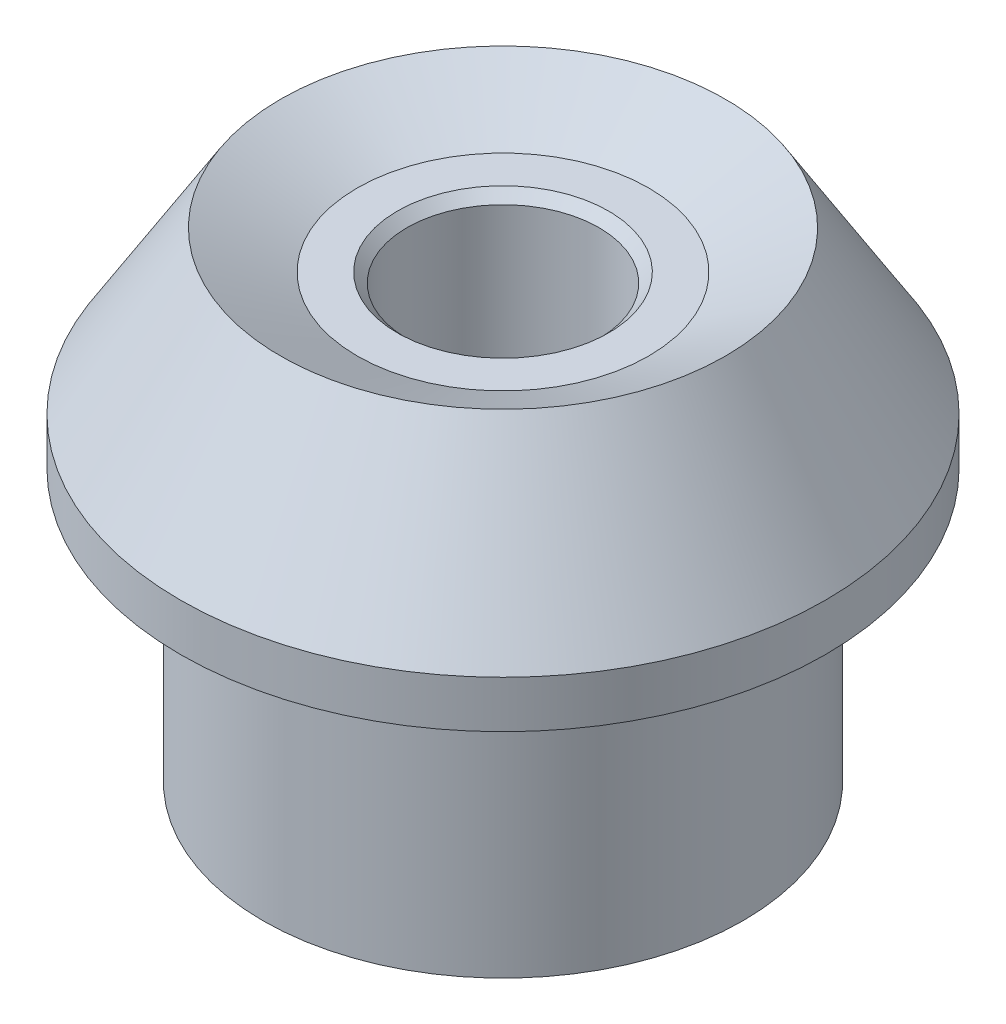
ISO-10303-21;
HEADER;
FILE_DESCRIPTION(('STEP AP214'),'2;1');
FILE_NAME('part.step','',(''),(''),'','','');
FILE_SCHEMA(('AUTOMOTIVE_DESIGN { 1 0 10303 214 1 1 1 1 }'));
ENDSEC;
DATA;
#1=APPLICATION_CONTEXT('core data for automotive mechanical design processes');
#2=APPLICATION_PROTOCOL_DEFINITION('international standard','automotive_design',2000,#1);
#3=PRODUCT_CONTEXT('',#1,'mechanical');
#4=PRODUCT('Part','Part','',(#3));
#5=PRODUCT_RELATED_PRODUCT_CATEGORY('part','',(#4));
#6=PRODUCT_DEFINITION_FORMATION('','',#4);
#7=PRODUCT_DEFINITION_CONTEXT('part definition',#1,'design');
#8=PRODUCT_DEFINITION('design','',#6,#7);
#9=PRODUCT_DEFINITION_SHAPE('','',#8);
#10=(LENGTH_UNIT() NAMED_UNIT(*) SI_UNIT(.MILLI.,.METRE.));
#11=(NAMED_UNIT(*) PLANE_ANGLE_UNIT() SI_UNIT($,.RADIAN.));
#12=(NAMED_UNIT(*) SI_UNIT($,.STERADIAN.) SOLID_ANGLE_UNIT());
#13=UNCERTAINTY_MEASURE_WITH_UNIT(LENGTH_MEASURE(1.E-05),#10,'distance_accuracy_value','');
#14=(GEOMETRIC_REPRESENTATION_CONTEXT(3) GLOBAL_UNCERTAINTY_ASSIGNED_CONTEXT((#13)) GLOBAL_UNIT_ASSIGNED_CONTEXT((#10,
#11,#12)) REPRESENTATION_CONTEXT('',''));
#15=CARTESIAN_POINT('',(0.,0.,0.));
#16=DIRECTION('',(0.,0.,1.));
#17=DIRECTION('',(1.,0.,0.));
#18=AXIS2_PLACEMENT_3D('',#15,#16,#17);
#19=CARTESIAN_POINT('',(7.5828586647019,23.,0.));
#20=DIRECTION('',(0.,1.,0.));
#21=DIRECTION('',(-1.,0.,0.));
#22=AXIS2_PLACEMENT_3D('',#19,#20,#21);
#23=PLANE('',#22);
#24=CARTESIAN_POINT('',(0.,23.0000000000246,0.));
#25=DIRECTION('',(0.,1.,0.));
#26=DIRECTION('',(-1.,0.,0.));
#27=AXIS2_PLACEMENT_3D('',#24,#25,#26);
#28=CIRCLE('',#27,5.49999999998361);
#29=CARTESIAN_POINT('',(-5.4999999999836,23.0000000000246,0.));
#30=VERTEX_POINT('',#29);
#31=EDGE_CURVE('E18',#30,#30,#28,.F.);
#32=ORIENTED_EDGE('',*,*,#31,.T.);
#33=EDGE_LOOP('',(#32));
#34=FACE_BOUND('',#33,.T.);
#35=CARTESIAN_POINT('',(0.,23.,0.));
#36=DIRECTION('',(0.,1.,0.));
#37=DIRECTION('',(-1.,0.,0.));
#38=AXIS2_PLACEMENT_3D('',#35,#36,#37);
#39=CIRCLE('',#38,7.5828586647019);
#40=CARTESIAN_POINT('',(-7.5828586647019,23.,0.));
#41=VERTEX_POINT('',#40);
#42=EDGE_CURVE('E43',#41,#41,#39,.T.);
#43=ORIENTED_EDGE('',*,*,#42,.T.);
#44=EDGE_LOOP('',(#43));
#45=FACE_BOUND('',#44,.T.);
#46=ADVANCED_FACE('F15',(#34,#45),#23,.T.);
#47=CARTESIAN_POINT('',(0.,22.9999999999677,0.));
#48=DIRECTION('',(0.,1.,0.));
#49=DIRECTION('',(-1.,0.,0.));
#50=AXIS2_PLACEMENT_3D('',#47,#48,#49);
#51=CONICAL_SURFACE('',#50,5.49999999992677,0.785398163340605);
#52=ORIENTED_EDGE('',*,*,#31,.F.);
#53=EDGE_LOOP('',(#52));
#54=FACE_BOUND('',#53,.T.);
#55=CARTESIAN_POINT('',(0.,22.5,0.));
#56=DIRECTION('',(0.,-1.,0.));
#57=DIRECTION('',(1.,0.,0.));
#58=AXIS2_PLACEMENT_3D('',#55,#56,#57);
#59=CIRCLE('',#58,5.);
#60=CARTESIAN_POINT('',(5.00000000000001,22.5,0.));
#61=VERTEX_POINT('',#60);
#62=EDGE_CURVE('E40',#61,#61,#59,.T.);
#63=ORIENTED_EDGE('',*,*,#62,.T.);
#64=EDGE_LOOP('',(#63));
#65=FACE_BOUND('',#64,.T.);
#66=ADVANCED_FACE('F54',(#54,#65),#51,.F.);
#67=CARTESIAN_POINT('',(0.,25.,0.));
#68=DIRECTION('',(0.,1.,0.));
#69=DIRECTION('',(-1.,0.,0.));
#70=AXIS2_PLACEMENT_3D('',#67,#68,#69);
#71=CONICAL_SURFACE('',#70,11.582858870141,1.107148738338);
#72=CARTESIAN_POINT('',(0.,25.,0.));
#73=DIRECTION('',(0.,-1.,0.));
#74=DIRECTION('',(1.,0.,0.));
#75=AXIS2_PLACEMENT_3D('',#72,#73,#74);
#76=CIRCLE('',#75,11.582858870141);
#77=CARTESIAN_POINT('',(11.582858870141,25.,0.));
#78=VERTEX_POINT('',#77);
#79=EDGE_CURVE('E37',#78,#78,#76,.T.);
#80=ORIENTED_EDGE('',*,*,#79,.F.);
#81=EDGE_LOOP('',(#80));
#82=FACE_BOUND('',#81,.T.);
#83=ORIENTED_EDGE('',*,*,#42,.F.);
#84=EDGE_LOOP('',(#83));
#85=FACE_BOUND('',#84,.T.);
#86=ADVANCED_FACE('F57',(#82,#85),#71,.F.);
#87=CARTESIAN_POINT('',(0.,21.845,0.));
#88=DIRECTION('',(0.,-1.,0.));
#89=DIRECTION('',(1.,0.,0.));
#90=AXIS2_PLACEMENT_3D('',#87,#88,#89);
#91=CYLINDRICAL_SURFACE('',#90,5.);
#92=CARTESIAN_POINT('',(0.,0.499999999988173,0.));
#93=DIRECTION('',(0.,-1.,0.));
#94=DIRECTION('',(-1.,0.,0.));
#95=AXIS2_PLACEMENT_3D('',#92,#93,#94);
#96=CIRCLE('',#95,4.99999999993861);
#97=CARTESIAN_POINT('',(-4.99999999993861,0.499999999988177,0.));
#98=VERTEX_POINT('',#97);
#99=EDGE_CURVE('E34',#98,#98,#96,.T.);
#100=ORIENTED_EDGE('',*,*,#99,.T.);
#101=EDGE_LOOP('',(#100));
#102=FACE_BOUND('',#101,.T.);
#103=ORIENTED_EDGE('',*,*,#62,.F.);
#104=EDGE_LOOP('',(#103));
#105=FACE_BOUND('',#104,.T.);
#106=ADVANCED_FACE('F60',(#102,#105),#91,.F.);
#107=CARTESIAN_POINT('',(0.,16.597802510747,0.));
#108=DIRECTION('',(0.,-1.,0.));
#109=DIRECTION('',(1.,0.,0.));
#110=AXIS2_PLACEMENT_3D('',#107,#108,#109);
#111=CONICAL_SURFACE('',#110,16.79,0.554804739025165);
#112=ORIENTED_EDGE('',*,*,#79,.T.);
#113=EDGE_LOOP('',(#112));
#114=FACE_BOUND('',#113,.T.);
#115=CARTESIAN_POINT('',(0.,16.597802510747,0.));
#116=DIRECTION('',(0.,-1.,0.));
#117=DIRECTION('',(1.,0.,0.));
#118=AXIS2_PLACEMENT_3D('',#115,#116,#117);
#119=CIRCLE('',#118,16.79);
#120=CARTESIAN_POINT('',(16.79,16.597802510747,0.));
#121=VERTEX_POINT('',#120);
#122=EDGE_CURVE('E30',#121,#121,#119,.T.);
#123=ORIENTED_EDGE('',*,*,#122,.F.);
#124=EDGE_LOOP('',(#123));
#125=FACE_BOUND('',#124,.T.);
#126=ADVANCED_FACE('F62',(#114,#125),#111,.T.);
#127=CARTESIAN_POINT('',(0.,0.,0.));
#128=DIRECTION('',(0.,-1.,0.));
#129=DIRECTION('',(1.,0.,0.));
#130=AXIS2_PLACEMENT_3D('',#127,#128,#129);
#131=CONICAL_SURFACE('',#130,5.49999999992679,0.785398163397448);
#132=CARTESIAN_POINT('',(0.,0.,0.));
#133=DIRECTION('',(0.,-1.,0.));
#134=DIRECTION('',(1.,0.,0.));
#135=AXIS2_PLACEMENT_3D('',#132,#133,#134);
#136=CIRCLE('',#135,5.49999999992678);
#137=CARTESIAN_POINT('',(5.49999999992678,0.,0.));
#138=VERTEX_POINT('',#137);
#139=EDGE_CURVE('E33',#138,#138,#136,.F.);
#140=ORIENTED_EDGE('',*,*,#139,.F.);
#141=EDGE_LOOP('',(#140));
#142=FACE_BOUND('',#141,.T.);
#143=ORIENTED_EDGE('',*,*,#99,.F.);
#144=EDGE_LOOP('',(#143));
#145=FACE_BOUND('',#144,.T.);
#146=ADVANCED_FACE('F70',(#142,#145),#131,.F.);
#147=CARTESIAN_POINT('',(0.,15.37140120029,0.));
#148=DIRECTION('',(0.,-1.,0.));
#149=DIRECTION('',(1.,0.,0.));
#150=AXIS2_PLACEMENT_3D('',#147,#148,#149);
#151=CYLINDRICAL_SURFACE('',#150,16.79);
#152=ORIENTED_EDGE('',*,*,#122,.T.);
#153=EDGE_LOOP('',(#152));
#154=FACE_BOUND('',#153,.T.);
#155=CARTESIAN_POINT('',(0.,14.144999889833,0.));
#156=DIRECTION('',(0.,1.,0.));
#157=DIRECTION('',(1.,0.,0.));
#158=AXIS2_PLACEMENT_3D('',#155,#156,#157);
#159=CIRCLE('',#158,16.79);
#160=CARTESIAN_POINT('',(16.79,14.144999889833,0.));
#161=VERTEX_POINT('',#160);
#162=EDGE_CURVE('E27',#161,#161,#159,.F.);
#163=ORIENTED_EDGE('',*,*,#162,.F.);
#164=EDGE_LOOP('',(#163));
#165=FACE_BOUND('',#164,.T.);
#166=ADVANCED_FACE('F89',(#154,#165),#151,.T.);
#167=CARTESIAN_POINT('',(0.,0.,0.));
#168=DIRECTION('',(0.,-1.,0.));
#169=DIRECTION('',(1.,0.,0.));
#170=AXIS2_PLACEMENT_3D('',#167,#168,#169);
#171=PLANE('',#170);
#172=ORIENTED_EDGE('',*,*,#139,.T.);
#173=EDGE_LOOP('',(#172));
#174=FACE_BOUND('',#173,.T.);
#175=CARTESIAN_POINT('',(0.,0.,0.));
#176=DIRECTION('',(0.,-1.,0.));
#177=DIRECTION('',(1.,0.,0.));
#178=AXIS2_PLACEMENT_3D('',#175,#176,#177);
#179=CIRCLE('',#178,12.5);
#180=CARTESIAN_POINT('',(12.5,0.,0.));
#181=VERTEX_POINT('',#180);
#182=EDGE_CURVE('E22',#181,#181,#179,.F.);
#183=ORIENTED_EDGE('',*,*,#182,.F.);
#184=EDGE_LOOP('',(#183));
#185=FACE_BOUND('',#184,.T.);
#186=ADVANCED_FACE('F82',(#174,#185),#171,.T.);
#187=CARTESIAN_POINT('',(0.,14.144999889833,0.));
#188=DIRECTION('',(0.,1.,0.));
#189=DIRECTION('',(-1.,0.,0.));
#190=AXIS2_PLACEMENT_3D('',#187,#188,#189);
#191=CONICAL_SURFACE('',#190,16.79,1.10714873833805);
#192=CARTESIAN_POINT('',(0.,12.,0.));
#193=DIRECTION('',(0.,-1.,0.));
#194=DIRECTION('',(1.,0.,0.));
#195=AXIS2_PLACEMENT_3D('',#192,#193,#194);
#196=CIRCLE('',#195,12.5);
#197=CARTESIAN_POINT('',(12.5,12.,0.));
#198=VERTEX_POINT('',#197);
#199=EDGE_CURVE('E10',#198,#198,#196,.T.);
#200=ORIENTED_EDGE('',*,*,#199,.F.);
#201=EDGE_LOOP('',(#200));
#202=FACE_BOUND('',#201,.T.);
#203=ORIENTED_EDGE('',*,*,#162,.T.);
#204=EDGE_LOOP('',(#203));
#205=FACE_BOUND('',#204,.T.);
#206=ADVANCED_FACE('F77',(#202,#205),#191,.T.);
#207=CARTESIAN_POINT('',(0.,6.00000000000001,0.));
#208=DIRECTION('',(0.,-1.,0.));
#209=DIRECTION('',(1.,0.,0.));
#210=AXIS2_PLACEMENT_3D('',#207,#208,#209);
#211=CYLINDRICAL_SURFACE('',#210,12.5);
#212=ORIENTED_EDGE('',*,*,#199,.T.);
#213=EDGE_LOOP('',(#212));
#214=FACE_BOUND('',#213,.T.);
#215=ORIENTED_EDGE('',*,*,#182,.T.);
#216=EDGE_LOOP('',(#215));
#217=FACE_BOUND('',#216,.T.);
#218=ADVANCED_FACE('F75',(#214,#217),#211,.T.);
#219=CLOSED_SHELL('',(#46,#66,#86,#106,#126,#146,#166,#186,#206,#218));
#220=MANIFOLD_SOLID_BREP('B1',#219);
#221=ADVANCED_BREP_SHAPE_REPRESENTATION('',(#18,#220),#14);
#222=SHAPE_DEFINITION_REPRESENTATION(#9,#221);
ENDSEC;
END-ISO-10303-21;
